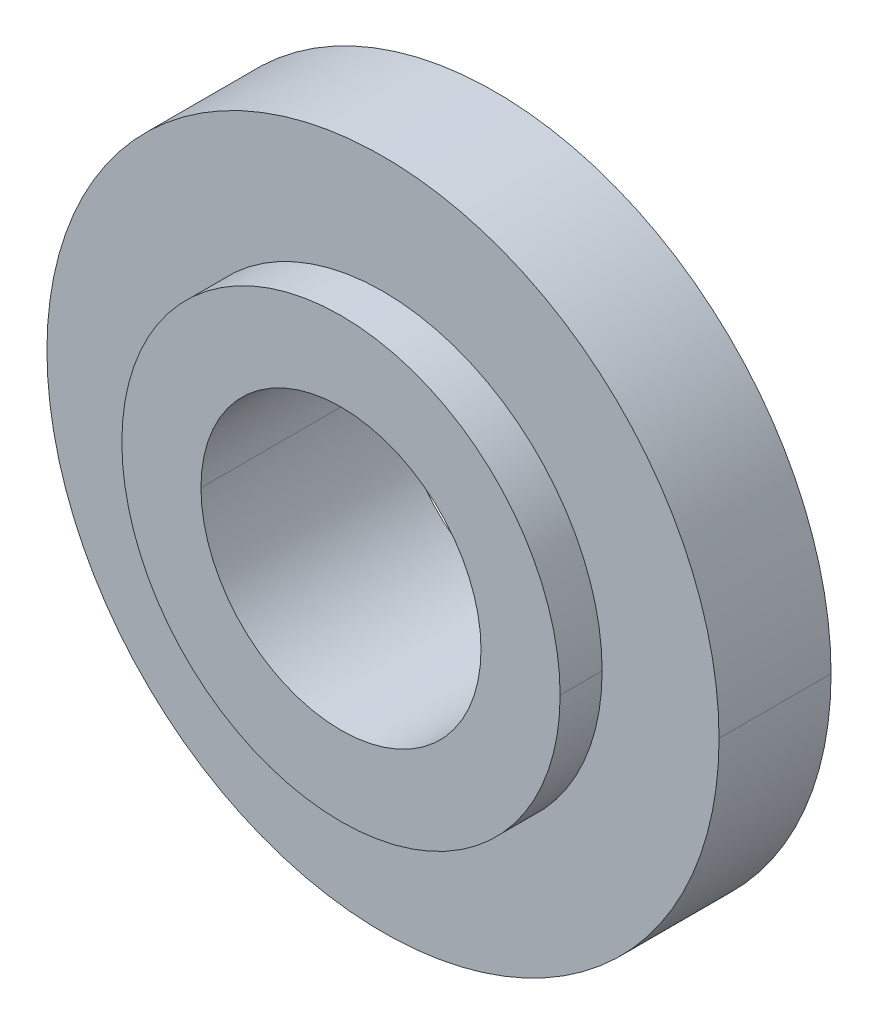
ISO-10303-21;
HEADER;
FILE_DESCRIPTION(('STEP AP214'),'2;1');
FILE_NAME('part.step','',(''),(''),'','','');
FILE_SCHEMA(('AUTOMOTIVE_DESIGN { 1 0 10303 214 1 1 1 1 }'));
ENDSEC;
DATA;
#1=APPLICATION_CONTEXT('core data for automotive mechanical design processes');
#2=APPLICATION_PROTOCOL_DEFINITION('international standard','automotive_design',2000,#1);
#3=PRODUCT_CONTEXT('',#1,'mechanical');
#4=PRODUCT('Part','Part','',(#3));
#5=PRODUCT_RELATED_PRODUCT_CATEGORY('part','',(#4));
#6=PRODUCT_DEFINITION_FORMATION('','',#4);
#7=PRODUCT_DEFINITION_CONTEXT('part definition',#1,'design');
#8=PRODUCT_DEFINITION('design','',#6,#7);
#9=PRODUCT_DEFINITION_SHAPE('','',#8);
#10=(LENGTH_UNIT() NAMED_UNIT(*) SI_UNIT(.MILLI.,.METRE.));
#11=(NAMED_UNIT(*) PLANE_ANGLE_UNIT() SI_UNIT($,.RADIAN.));
#12=(NAMED_UNIT(*) SI_UNIT($,.STERADIAN.) SOLID_ANGLE_UNIT());
#13=UNCERTAINTY_MEASURE_WITH_UNIT(LENGTH_MEASURE(1.E-05),#10,'distance_accuracy_value','');
#14=(GEOMETRIC_REPRESENTATION_CONTEXT(3) GLOBAL_UNCERTAINTY_ASSIGNED_CONTEXT((#13)) GLOBAL_UNIT_ASSIGNED_CONTEXT((#10,
#11,#12)) REPRESENTATION_CONTEXT('',''));
#15=CARTESIAN_POINT('',(0.,0.,0.));
#16=DIRECTION('',(0.,0.,1.));
#17=DIRECTION('',(1.,0.,0.));
#18=AXIS2_PLACEMENT_3D('',#15,#16,#17);
#19=CARTESIAN_POINT('',(0.,0.,0.7));
#20=DIRECTION('',(0.,0.,-1.));
#21=DIRECTION('',(-1.,0.,0.));
#22=AXIS2_PLACEMENT_3D('',#19,#20,#21);
#23=CYLINDRICAL_SURFACE('',#22,1.565);
#24=DIRECTION('',(0.,0.,-1.));
#25=VECTOR('',#24,1.);
#26=CARTESIAN_POINT('',(1.565,0.,0.7));
#27=LINE('',#26,#25);
#28=CARTESIAN_POINT('',(1.565,0.,0.7));
#29=VERTEX_POINT('',#28);
#30=CARTESIAN_POINT('',(1.565,0.,0.4));
#31=VERTEX_POINT('',#30);
#32=EDGE_CURVE('E111',#29,#31,#27,.T.);
#33=ORIENTED_EDGE('',*,*,#32,.F.);
#34=CARTESIAN_POINT('',(0.,0.,0.7));
#35=DIRECTION('',(0.,0.,1.));
#36=DIRECTION('',(1.,0.,0.));
#37=AXIS2_PLACEMENT_3D('',#34,#35,#36);
#38=CIRCLE('',#37,1.565);
#39=CARTESIAN_POINT('',(-1.565,0.,0.7));
#40=VERTEX_POINT('',#39);
#41=EDGE_CURVE('E11',#40,#29,#38,.T.);
#42=ORIENTED_EDGE('',*,*,#41,.F.);
#43=DIRECTION('',(0.,0.,-1.));
#44=VECTOR('',#43,1.);
#45=CARTESIAN_POINT('',(-1.565,0.,0.7));
#46=LINE('',#45,#44);
#47=CARTESIAN_POINT('',(-1.565,0.,0.4));
#48=VERTEX_POINT('',#47);
#49=EDGE_CURVE('E120',#40,#48,#46,.T.);
#50=ORIENTED_EDGE('',*,*,#49,.T.);
#51=CARTESIAN_POINT('',(0.,0.,0.4));
#52=DIRECTION('',(0.,0.,-1.));
#53=DIRECTION('',(1.,0.,0.));
#54=AXIS2_PLACEMENT_3D('',#51,#52,#53);
#55=CIRCLE('',#54,1.565);
#56=EDGE_CURVE('E112',#31,#48,#55,.T.);
#57=ORIENTED_EDGE('',*,*,#56,.F.);
#58=EDGE_LOOP('',(#33,#42,#50,#57));
#59=FACE_BOUND('',#58,.T.);
#60=ADVANCED_FACE('F17',(#59),#23,.T.);
#61=CARTESIAN_POINT('',(0.,0.,0.7));
#62=DIRECTION('',(0.,0.,1.));
#63=DIRECTION('',(1.,0.,0.));
#64=AXIS2_PLACEMENT_3D('',#61,#62,#63);
#65=PLANE('',#64);
#66=CARTESIAN_POINT('',(0.,0.,0.7));
#67=DIRECTION('',(0.,0.,1.));
#68=DIRECTION('',(1.,0.,0.));
#69=AXIS2_PLACEMENT_3D('',#66,#67,#68);
#70=CIRCLE('',#69,1.);
#71=CARTESIAN_POINT('',(-1.,0.,0.7));
#72=VERTEX_POINT('',#71);
#73=CARTESIAN_POINT('',(1.,0.,0.7));
#74=VERTEX_POINT('',#73);
#75=EDGE_CURVE('E134',#72,#74,#70,.T.);
#76=ORIENTED_EDGE('',*,*,#75,.F.);
#77=CARTESIAN_POINT('',(0.,0.,0.7));
#78=DIRECTION('',(0.,0.,1.));
#79=DIRECTION('',(1.,0.,0.));
#80=AXIS2_PLACEMENT_3D('',#77,#78,#79);
#81=CIRCLE('',#80,1.);
#82=EDGE_CURVE('E25',#74,#72,#81,.T.);
#83=ORIENTED_EDGE('',*,*,#82,.F.);
#84=EDGE_LOOP('',(#76,#83));
#85=FACE_BOUND('',#84,.T.);
#86=ORIENTED_EDGE('',*,*,#41,.T.);
#87=CARTESIAN_POINT('',(0.,0.,0.7));
#88=DIRECTION('',(0.,0.,1.));
#89=DIRECTION('',(1.,0.,0.));
#90=AXIS2_PLACEMENT_3D('',#87,#88,#89);
#91=CIRCLE('',#90,1.565);
#92=EDGE_CURVE('E106',#29,#40,#91,.T.);
#93=ORIENTED_EDGE('',*,*,#92,.T.);
#94=EDGE_LOOP('',(#86,#93));
#95=FACE_BOUND('',#94,.T.);
#96=ADVANCED_FACE('F104',(#85,#95),#65,.T.);
#97=CARTESIAN_POINT('',(0.,0.,0.4));
#98=DIRECTION('',(0.,0.,-1.));
#99=DIRECTION('',(-1.,0.,0.));
#100=AXIS2_PLACEMENT_3D('',#97,#98,#99);
#101=CYLINDRICAL_SURFACE('',#100,1.);
#102=DIRECTION('',(0.,0.,-1.));
#103=VECTOR('',#102,1.);
#104=CARTESIAN_POINT('',(1.,0.,0.4));
#105=LINE('',#104,#103);
#106=CARTESIAN_POINT('',(1.,0.,-0.7));
#107=VERTEX_POINT('',#106);
#108=EDGE_CURVE('E140',#74,#107,#105,.T.);
#109=ORIENTED_EDGE('',*,*,#108,.F.);
#110=ORIENTED_EDGE('',*,*,#82,.T.);
#111=DIRECTION('',(0.,0.,-1.));
#112=VECTOR('',#111,1.);
#113=CARTESIAN_POINT('',(-1.,0.,0.4));
#114=LINE('',#113,#112);
#115=CARTESIAN_POINT('',(-1.,0.,-0.7));
#116=VERTEX_POINT('',#115);
#117=EDGE_CURVE('E148',#72,#116,#114,.T.);
#118=ORIENTED_EDGE('',*,*,#117,.T.);
#119=CARTESIAN_POINT('',(0.,0.,-0.7));
#120=DIRECTION('',(0.,0.,1.));
#121=DIRECTION('',(1.,0.,0.));
#122=AXIS2_PLACEMENT_3D('',#119,#120,#121);
#123=CIRCLE('',#122,1.);
#124=EDGE_CURVE('E190',#107,#116,#123,.T.);
#125=ORIENTED_EDGE('',*,*,#124,.F.);
#126=EDGE_LOOP('',(#109,#110,#118,#125));
#127=FACE_BOUND('',#126,.T.);
#128=ADVANCED_FACE('F198',(#127),#101,.F.);
#129=CARTESIAN_POINT('',(0.,0.,-0.7));
#130=DIRECTION('',(0.,0.,1.));
#131=DIRECTION('',(1.,0.,0.));
#132=AXIS2_PLACEMENT_3D('',#129,#130,#131);
#133=PLANE('',#132);
#134=CARTESIAN_POINT('',(0.,0.,-0.7));
#135=DIRECTION('',(0.,0.,1.));
#136=DIRECTION('',(1.,0.,0.));
#137=AXIS2_PLACEMENT_3D('',#134,#135,#136);
#138=CIRCLE('',#137,1.);
#139=EDGE_CURVE('E144',#116,#107,#138,.T.);
#140=ORIENTED_EDGE('',*,*,#139,.T.);
#141=ORIENTED_EDGE('',*,*,#124,.T.);
#142=EDGE_LOOP('',(#140,#141));
#143=FACE_BOUND('',#142,.T.);
#144=CARTESIAN_POINT('',(0.,0.,-0.7));
#145=DIRECTION('',(0.,0.,1.));
#146=DIRECTION('',(1.,0.,0.));
#147=AXIS2_PLACEMENT_3D('',#144,#145,#146);
#148=CIRCLE('',#147,1.565);
#149=CARTESIAN_POINT('',(-1.565,0.,-0.7));
#150=VERTEX_POINT('',#149);
#151=CARTESIAN_POINT('',(1.565,0.,-0.7));
#152=VERTEX_POINT('',#151);
#153=EDGE_CURVE('E187',#150,#152,#148,.T.);
#154=ORIENTED_EDGE('',*,*,#153,.F.);
#155=CARTESIAN_POINT('',(0.,0.,-0.7));
#156=DIRECTION('',(0.,0.,1.));
#157=DIRECTION('',(1.,0.,0.));
#158=AXIS2_PLACEMENT_3D('',#155,#156,#157);
#159=CIRCLE('',#158,1.565);
#160=EDGE_CURVE('E157',#152,#150,#159,.T.);
#161=ORIENTED_EDGE('',*,*,#160,.F.);
#162=EDGE_LOOP('',(#154,#161));
#163=FACE_BOUND('',#162,.T.);
#164=ADVANCED_FACE('F212',(#143,#163),#133,.F.);
#165=CARTESIAN_POINT('',(0.,0.,0.7));
#166=DIRECTION('',(0.,0.,-1.));
#167=DIRECTION('',(-1.,0.,0.));
#168=AXIS2_PLACEMENT_3D('',#165,#166,#167);
#169=CYLINDRICAL_SURFACE('',#168,1.565);
#170=DIRECTION('',(0.,0.,-1.));
#171=VECTOR('',#170,1.);
#172=CARTESIAN_POINT('',(1.565,0.,0.7));
#173=LINE('',#172,#171);
#174=CARTESIAN_POINT('',(1.565,0.,-0.4));
#175=VERTEX_POINT('',#174);
#176=EDGE_CURVE('E161',#175,#152,#173,.T.);
#177=ORIENTED_EDGE('',*,*,#176,.F.);
#178=CARTESIAN_POINT('',(0.,0.,-0.4));
#179=DIRECTION('',(0.,0.,-1.));
#180=DIRECTION('',(1.,0.,0.));
#181=AXIS2_PLACEMENT_3D('',#178,#179,#180);
#182=CIRCLE('',#181,1.565);
#183=CARTESIAN_POINT('',(-1.565,0.,-0.4));
#184=VERTEX_POINT('',#183);
#185=EDGE_CURVE('E177',#175,#184,#182,.T.);
#186=ORIENTED_EDGE('',*,*,#185,.T.);
#187=DIRECTION('',(0.,0.,-1.));
#188=VECTOR('',#187,1.);
#189=CARTESIAN_POINT('',(-1.565,0.,0.7));
#190=LINE('',#189,#188);
#191=EDGE_CURVE('E152',#184,#150,#190,.T.);
#192=ORIENTED_EDGE('',*,*,#191,.T.);
#193=ORIENTED_EDGE('',*,*,#153,.T.);
#194=EDGE_LOOP('',(#177,#186,#192,#193));
#195=FACE_BOUND('',#194,.T.);
#196=ADVANCED_FACE('F237',(#195),#169,.T.);
#197=CARTESIAN_POINT('',(0.,0.,0.4));
#198=DIRECTION('',(0.,0.,-1.));
#199=DIRECTION('',(-1.,0.,0.));
#200=AXIS2_PLACEMENT_3D('',#197,#198,#199);
#201=CYLINDRICAL_SURFACE('',#200,2.4);
#202=DIRECTION('',(0.,0.,-1.));
#203=VECTOR('',#202,1.);
#204=CARTESIAN_POINT('',(2.4,0.,0.4));
#205=LINE('',#204,#203);
#206=CARTESIAN_POINT('',(2.4,0.,0.4));
#207=VERTEX_POINT('',#206);
#208=CARTESIAN_POINT('',(2.4,0.,-0.4));
#209=VERTEX_POINT('',#208);
#210=EDGE_CURVE('E127',#207,#209,#205,.T.);
#211=ORIENTED_EDGE('',*,*,#210,.F.);
#212=CARTESIAN_POINT('',(0.,0.,0.4));
#213=DIRECTION('',(0.,0.,1.));
#214=DIRECTION('',(1.,0.,0.));
#215=AXIS2_PLACEMENT_3D('',#212,#213,#214);
#216=CIRCLE('',#215,2.4);
#217=CARTESIAN_POINT('',(-2.4,0.,0.4));
#218=VERTEX_POINT('',#217);
#219=EDGE_CURVE('E180',#218,#207,#216,.T.);
#220=ORIENTED_EDGE('',*,*,#219,.F.);
#221=DIRECTION('',(0.,0.,-1.));
#222=VECTOR('',#221,1.);
#223=CARTESIAN_POINT('',(-2.4,0.,0.4));
#224=LINE('',#223,#222);
#225=CARTESIAN_POINT('',(-2.4,0.,-0.4));
#226=VERTEX_POINT('',#225);
#227=EDGE_CURVE('E174',#218,#226,#224,.T.);
#228=ORIENTED_EDGE('',*,*,#227,.T.);
#229=CARTESIAN_POINT('',(0.,0.,-0.4));
#230=DIRECTION('',(0.,0.,1.));
#231=DIRECTION('',(1.,0.,0.));
#232=AXIS2_PLACEMENT_3D('',#229,#230,#231);
#233=CIRCLE('',#232,2.4);
#234=EDGE_CURVE('E37',#226,#209,#233,.T.);
#235=ORIENTED_EDGE('',*,*,#234,.T.);
#236=EDGE_LOOP('',(#211,#220,#228,#235));
#237=FACE_BOUND('',#236,.T.);
#238=ADVANCED_FACE('F233',(#237),#201,.T.);
#239=CARTESIAN_POINT('',(0.,0.,-0.4));
#240=DIRECTION('',(0.,0.,1.));
#241=DIRECTION('',(1.,0.,0.));
#242=AXIS2_PLACEMENT_3D('',#239,#240,#241);
#243=PLANE('',#242);
#244=CARTESIAN_POINT('',(0.,0.,-0.4));
#245=DIRECTION('',(0.,0.,-1.));
#246=DIRECTION('',(1.,0.,0.));
#247=AXIS2_PLACEMENT_3D('',#244,#245,#246);
#248=CIRCLE('',#247,1.565);
#249=EDGE_CURVE('E156',#184,#175,#248,.T.);
#250=ORIENTED_EDGE('',*,*,#249,.F.);
#251=ORIENTED_EDGE('',*,*,#185,.F.);
#252=EDGE_LOOP('',(#250,#251));
#253=FACE_BOUND('',#252,.T.);
#254=ORIENTED_EDGE('',*,*,#234,.F.);
#255=CARTESIAN_POINT('',(0.,0.,-0.4));
#256=DIRECTION('',(0.,0.,1.));
#257=DIRECTION('',(1.,0.,0.));
#258=AXIS2_PLACEMENT_3D('',#255,#256,#257);
#259=CIRCLE('',#258,2.4);
#260=EDGE_CURVE('E129',#209,#226,#259,.T.);
#261=ORIENTED_EDGE('',*,*,#260,.F.);
#262=EDGE_LOOP('',(#254,#261));
#263=FACE_BOUND('',#262,.T.);
#264=ADVANCED_FACE('F229',(#253,#263),#243,.F.);
#265=CARTESIAN_POINT('',(0.,0.,0.4));
#266=DIRECTION('',(0.,0.,1.));
#267=DIRECTION('',(1.,0.,0.));
#268=AXIS2_PLACEMENT_3D('',#265,#266,#267);
#269=PLANE('',#268);
#270=CARTESIAN_POINT('',(0.,0.,0.4));
#271=DIRECTION('',(0.,0.,-1.));
#272=DIRECTION('',(1.,0.,0.));
#273=AXIS2_PLACEMENT_3D('',#270,#271,#272);
#274=CIRCLE('',#273,1.565);
#275=EDGE_CURVE('E117',#48,#31,#274,.T.);
#276=ORIENTED_EDGE('',*,*,#275,.T.);
#277=ORIENTED_EDGE('',*,*,#56,.T.);
#278=EDGE_LOOP('',(#276,#277));
#279=FACE_BOUND('',#278,.T.);
#280=ORIENTED_EDGE('',*,*,#219,.T.);
#281=CARTESIAN_POINT('',(0.,0.,0.4));
#282=DIRECTION('',(0.,0.,1.));
#283=DIRECTION('',(1.,0.,0.));
#284=AXIS2_PLACEMENT_3D('',#281,#282,#283);
#285=CIRCLE('',#284,2.4);
#286=EDGE_CURVE('E130',#207,#218,#285,.T.);
#287=ORIENTED_EDGE('',*,*,#286,.T.);
#288=EDGE_LOOP('',(#280,#287));
#289=FACE_BOUND('',#288,.T.);
#290=ADVANCED_FACE('F225',(#279,#289),#269,.T.);
#291=CARTESIAN_POINT('',(0.,0.,0.4));
#292=DIRECTION('',(0.,0.,-1.));
#293=DIRECTION('',(-1.,0.,0.));
#294=AXIS2_PLACEMENT_3D('',#291,#292,#293);
#295=CYLINDRICAL_SURFACE('',#294,2.4);
#296=ORIENTED_EDGE('',*,*,#286,.F.);
#297=ORIENTED_EDGE('',*,*,#210,.T.);
#298=ORIENTED_EDGE('',*,*,#260,.T.);
#299=ORIENTED_EDGE('',*,*,#227,.F.);
#300=EDGE_LOOP('',(#296,#297,#298,#299));
#301=FACE_BOUND('',#300,.T.);
#302=ADVANCED_FACE('F221',(#301),#295,.T.);
#303=CARTESIAN_POINT('',(0.,0.,0.7));
#304=DIRECTION('',(0.,0.,-1.));
#305=DIRECTION('',(-1.,0.,0.));
#306=AXIS2_PLACEMENT_3D('',#303,#304,#305);
#307=CYLINDRICAL_SURFACE('',#306,1.565);
#308=ORIENTED_EDGE('',*,*,#249,.T.);
#309=ORIENTED_EDGE('',*,*,#176,.T.);
#310=ORIENTED_EDGE('',*,*,#160,.T.);
#311=ORIENTED_EDGE('',*,*,#191,.F.);
#312=EDGE_LOOP('',(#308,#309,#310,#311));
#313=FACE_BOUND('',#312,.T.);
#314=ADVANCED_FACE('F218',(#313),#307,.T.);
#315=CARTESIAN_POINT('',(0.,0.,0.4));
#316=DIRECTION('',(0.,0.,-1.));
#317=DIRECTION('',(-1.,0.,0.));
#318=AXIS2_PLACEMENT_3D('',#315,#316,#317);
#319=CYLINDRICAL_SURFACE('',#318,1.);
#320=ORIENTED_EDGE('',*,*,#75,.T.);
#321=ORIENTED_EDGE('',*,*,#108,.T.);
#322=ORIENTED_EDGE('',*,*,#139,.F.);
#323=ORIENTED_EDGE('',*,*,#117,.F.);
#324=EDGE_LOOP('',(#320,#321,#322,#323));
#325=FACE_BOUND('',#324,.T.);
#326=ADVANCED_FACE('F203',(#325),#319,.F.);
#327=CARTESIAN_POINT('',(0.,0.,0.7));
#328=DIRECTION('',(0.,0.,-1.));
#329=DIRECTION('',(-1.,0.,0.));
#330=AXIS2_PLACEMENT_3D('',#327,#328,#329);
#331=CYLINDRICAL_SURFACE('',#330,1.565);
#332=ORIENTED_EDGE('',*,*,#92,.F.);
#333=ORIENTED_EDGE('',*,*,#32,.T.);
#334=ORIENTED_EDGE('',*,*,#275,.F.);
#335=ORIENTED_EDGE('',*,*,#49,.F.);
#336=EDGE_LOOP('',(#332,#333,#334,#335));
#337=FACE_BOUND('',#336,.T.);
#338=ADVANCED_FACE('F119',(#337),#331,.T.);
#339=CLOSED_SHELL('',(#60,#96,#128,#164,#196,#238,#264,#290,#302,#314,#326,#338));
#340=MANIFOLD_SOLID_BREP('B1',#339);
#341=ADVANCED_BREP_SHAPE_REPRESENTATION('',(#18,#340),#14);
#342=SHAPE_DEFINITION_REPRESENTATION(#9,#341);
ENDSEC;
END-ISO-10303-21;
